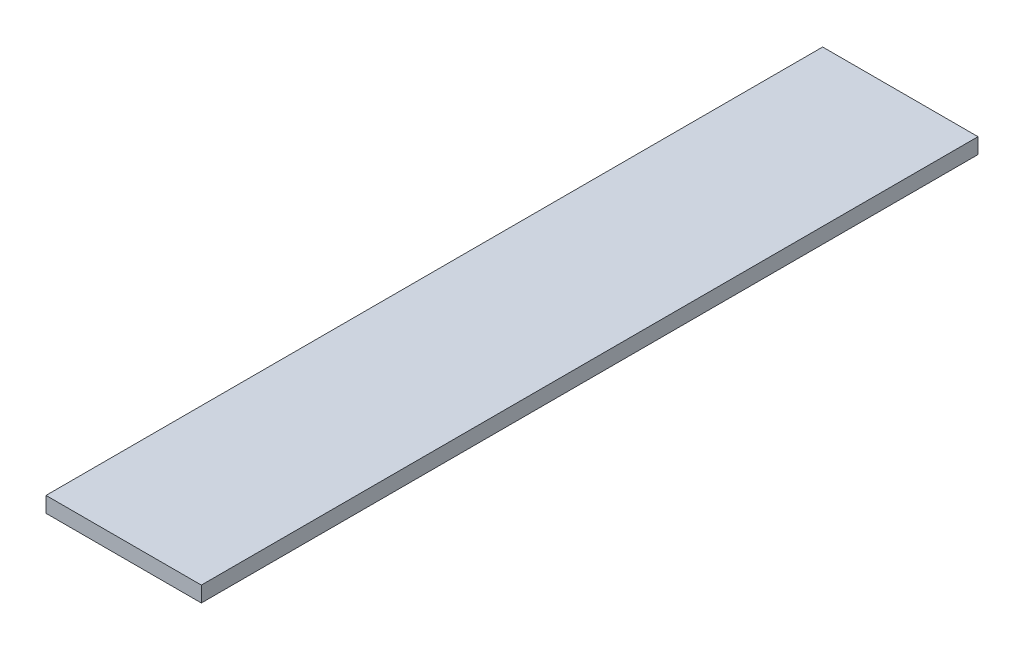
ISO-10303-21;
HEADER;
FILE_DESCRIPTION(('STEP AP214'),'2;1');
FILE_NAME('part.step','',(''),(''),'','','');
FILE_SCHEMA(('AUTOMOTIVE_DESIGN { 1 0 10303 214 1 1 1 1 }'));
ENDSEC;
DATA;
#1=APPLICATION_CONTEXT('core data for automotive mechanical design processes');
#2=APPLICATION_PROTOCOL_DEFINITION('international standard','automotive_design',2000,#1);
#3=PRODUCT_CONTEXT('',#1,'mechanical');
#4=PRODUCT('Part','Part','',(#3));
#5=PRODUCT_RELATED_PRODUCT_CATEGORY('part','',(#4));
#6=PRODUCT_DEFINITION_FORMATION('','',#4);
#7=PRODUCT_DEFINITION_CONTEXT('part definition',#1,'design');
#8=PRODUCT_DEFINITION('design','',#6,#7);
#9=PRODUCT_DEFINITION_SHAPE('','',#8);
#10=(LENGTH_UNIT() NAMED_UNIT(*) SI_UNIT(.MILLI.,.METRE.));
#11=(NAMED_UNIT(*) PLANE_ANGLE_UNIT() SI_UNIT($,.RADIAN.));
#12=(NAMED_UNIT(*) SI_UNIT($,.STERADIAN.) SOLID_ANGLE_UNIT());
#13=UNCERTAINTY_MEASURE_WITH_UNIT(LENGTH_MEASURE(1.E-05),#10,'distance_accuracy_value','');
#14=(GEOMETRIC_REPRESENTATION_CONTEXT(3) GLOBAL_UNCERTAINTY_ASSIGNED_CONTEXT((#13)) GLOBAL_UNIT_ASSIGNED_CONTEXT((#10,
#11,#12)) REPRESENTATION_CONTEXT('',''));
#15=CARTESIAN_POINT('',(0.,0.,0.));
#16=DIRECTION('',(0.,0.,1.));
#17=DIRECTION('',(1.,0.,0.));
#18=AXIS2_PLACEMENT_3D('',#15,#16,#17);
#19=CARTESIAN_POINT('',(0.,0.,100000.));
#20=DIRECTION('',(1.,0.,0.));
#21=DIRECTION('',(0.,0.,-1.));
#22=AXIS2_PLACEMENT_3D('',#19,#20,#21);
#23=PLANE('',#22);
#24=DIRECTION('',(0.,-1.,0.));
#25=VECTOR('',#24,1.);
#26=CARTESIAN_POINT('',(0.,0.,0.));
#27=LINE('',#26,#25);
#28=CARTESIAN_POINT('',(0.,0.,0.));
#29=VERTEX_POINT('',#28);
#30=CARTESIAN_POINT('',(0.,-2000.,0.));
#31=VERTEX_POINT('',#30);
#32=EDGE_CURVE('E114',#29,#31,#27,.T.);
#33=ORIENTED_EDGE('',*,*,#32,.T.);
#34=DIRECTION('',(0.,0.,-1.));
#35=VECTOR('',#34,1.);
#36=CARTESIAN_POINT('',(0.,-2000.,100000.));
#37=LINE('',#36,#35);
#38=CARTESIAN_POINT('',(0.,-2000.,100000.));
#39=VERTEX_POINT('',#38);
#40=EDGE_CURVE('E11',#39,#31,#37,.T.);
#41=ORIENTED_EDGE('',*,*,#40,.F.);
#42=DIRECTION('',(0.,-1.,0.));
#43=VECTOR('',#42,1.);
#44=CARTESIAN_POINT('',(0.,0.,100000.));
#45=LINE('',#44,#43);
#46=CARTESIAN_POINT('',(0.,0.,100000.));
#47=VERTEX_POINT('',#46);
#48=EDGE_CURVE('E97',#47,#39,#45,.T.);
#49=ORIENTED_EDGE('',*,*,#48,.F.);
#50=DIRECTION('',(0.,0.,-1.));
#51=VECTOR('',#50,1.);
#52=CARTESIAN_POINT('',(0.,0.,100000.));
#53=LINE('',#52,#51);
#54=EDGE_CURVE('E110',#47,#29,#53,.T.);
#55=ORIENTED_EDGE('',*,*,#54,.T.);
#56=EDGE_LOOP('',(#33,#41,#49,#55));
#57=FACE_BOUND('',#56,.T.);
#58=ADVANCED_FACE('F45',(#57),#23,.F.);
#59=CARTESIAN_POINT('',(0.,-2000.,100000.));
#60=DIRECTION('',(0.,1.,0.));
#61=DIRECTION('',(0.,0.,1.));
#62=AXIS2_PLACEMENT_3D('',#59,#60,#61);
#63=PLANE('',#62);
#64=DIRECTION('',(1.,0.,0.));
#65=VECTOR('',#64,1.);
#66=CARTESIAN_POINT('',(0.,-2000.,0.));
#67=LINE('',#66,#65);
#68=CARTESIAN_POINT('',(20000.,-2000.,0.));
#69=VERTEX_POINT('',#68);
#70=EDGE_CURVE('E102',#31,#69,#67,.T.);
#71=ORIENTED_EDGE('',*,*,#70,.T.);
#72=DIRECTION('',(0.,0.,-1.));
#73=VECTOR('',#72,1.);
#74=CARTESIAN_POINT('',(20000.,-2000.,100000.));
#75=LINE('',#74,#73);
#76=CARTESIAN_POINT('',(20000.,-2000.,100000.));
#77=VERTEX_POINT('',#76);
#78=EDGE_CURVE('E54',#77,#69,#75,.T.);
#79=ORIENTED_EDGE('',*,*,#78,.F.);
#80=DIRECTION('',(1.,0.,0.));
#81=VECTOR('',#80,1.);
#82=CARTESIAN_POINT('',(0.,-2000.,100000.));
#83=LINE('',#82,#81);
#84=EDGE_CURVE('E92',#39,#77,#83,.T.);
#85=ORIENTED_EDGE('',*,*,#84,.F.);
#86=ORIENTED_EDGE('',*,*,#40,.T.);
#87=EDGE_LOOP('',(#71,#79,#85,#86));
#88=FACE_BOUND('',#87,.T.);
#89=ADVANCED_FACE('F101',(#88),#63,.F.);
#90=CARTESIAN_POINT('',(20000.,0.,100000.));
#91=DIRECTION('',(-1.,0.,0.));
#92=DIRECTION('',(0.,0.,1.));
#93=AXIS2_PLACEMENT_3D('',#90,#91,#92);
#94=PLANE('',#93);
#95=DIRECTION('',(0.,1.,0.));
#96=VECTOR('',#95,1.);
#97=CARTESIAN_POINT('',(20000.,0.,0.));
#98=LINE('',#97,#96);
#99=CARTESIAN_POINT('',(20000.,0.,0.));
#100=VERTEX_POINT('',#99);
#101=EDGE_CURVE('E79',#69,#100,#98,.T.);
#102=ORIENTED_EDGE('',*,*,#101,.T.);
#103=DIRECTION('',(0.,0.,-1.));
#104=VECTOR('',#103,1.);
#105=CARTESIAN_POINT('',(20000.,0.,100000.));
#106=LINE('',#105,#104);
#107=CARTESIAN_POINT('',(20000.,0.,100000.));
#108=VERTEX_POINT('',#107);
#109=EDGE_CURVE('E104',#108,#100,#106,.T.);
#110=ORIENTED_EDGE('',*,*,#109,.F.);
#111=DIRECTION('',(0.,1.,0.));
#112=VECTOR('',#111,1.);
#113=CARTESIAN_POINT('',(20000.,0.,100000.));
#114=LINE('',#113,#112);
#115=EDGE_CURVE('E95',#77,#108,#114,.T.);
#116=ORIENTED_EDGE('',*,*,#115,.F.);
#117=ORIENTED_EDGE('',*,*,#78,.T.);
#118=EDGE_LOOP('',(#102,#110,#116,#117));
#119=FACE_BOUND('',#118,.T.);
#120=ADVANCED_FACE('F105',(#119),#94,.F.);
#121=CARTESIAN_POINT('',(0.,0.,100000.));
#122=DIRECTION('',(0.,-1.,0.));
#123=DIRECTION('',(0.,0.,-1.));
#124=AXIS2_PLACEMENT_3D('',#121,#122,#123);
#125=PLANE('',#124);
#126=DIRECTION('',(-1.,0.,0.));
#127=VECTOR('',#126,1.);
#128=CARTESIAN_POINT('',(0.,0.,0.));
#129=LINE('',#128,#127);
#130=EDGE_CURVE('E85',#100,#29,#129,.T.);
#131=ORIENTED_EDGE('',*,*,#130,.T.);
#132=ORIENTED_EDGE('',*,*,#54,.F.);
#133=DIRECTION('',(-1.,0.,0.));
#134=VECTOR('',#133,1.);
#135=CARTESIAN_POINT('',(0.,0.,100000.));
#136=LINE('',#135,#134);
#137=EDGE_CURVE('E62',#108,#47,#136,.T.);
#138=ORIENTED_EDGE('',*,*,#137,.F.);
#139=ORIENTED_EDGE('',*,*,#109,.T.);
#140=EDGE_LOOP('',(#131,#132,#138,#139));
#141=FACE_BOUND('',#140,.T.);
#142=ADVANCED_FACE('F128',(#141),#125,.F.);
#143=CARTESIAN_POINT('',(0.,0.,100000.));
#144=DIRECTION('',(0.,0.,1.));
#145=DIRECTION('',(1.,0.,0.));
#146=AXIS2_PLACEMENT_3D('',#143,#144,#145);
#147=PLANE('',#146);
#148=ORIENTED_EDGE('',*,*,#48,.T.);
#149=ORIENTED_EDGE('',*,*,#84,.T.);
#150=ORIENTED_EDGE('',*,*,#115,.T.);
#151=ORIENTED_EDGE('',*,*,#137,.T.);
#152=EDGE_LOOP('',(#148,#149,#150,#151));
#153=FACE_BOUND('',#152,.T.);
#154=ADVANCED_FACE('F93',(#153),#147,.T.);
#155=CARTESIAN_POINT('',(0.,0.,0.));
#156=DIRECTION('',(0.,0.,1.));
#157=DIRECTION('',(1.,0.,0.));
#158=AXIS2_PLACEMENT_3D('',#155,#156,#157);
#159=PLANE('',#158);
#160=ORIENTED_EDGE('',*,*,#32,.F.);
#161=ORIENTED_EDGE('',*,*,#130,.F.);
#162=ORIENTED_EDGE('',*,*,#101,.F.);
#163=ORIENTED_EDGE('',*,*,#70,.F.);
#164=EDGE_LOOP('',(#160,#161,#162,#163));
#165=FACE_BOUND('',#164,.T.);
#166=ADVANCED_FACE('F131',(#165),#159,.F.);
#167=CLOSED_SHELL('',(#58,#89,#120,#142,#154,#166));
#168=MANIFOLD_SOLID_BREP('B2',#167);
#169=ADVANCED_BREP_SHAPE_REPRESENTATION('',(#18,#168),#14);
#170=SHAPE_DEFINITION_REPRESENTATION(#9,#169);
ENDSEC;
END-ISO-10303-21;
